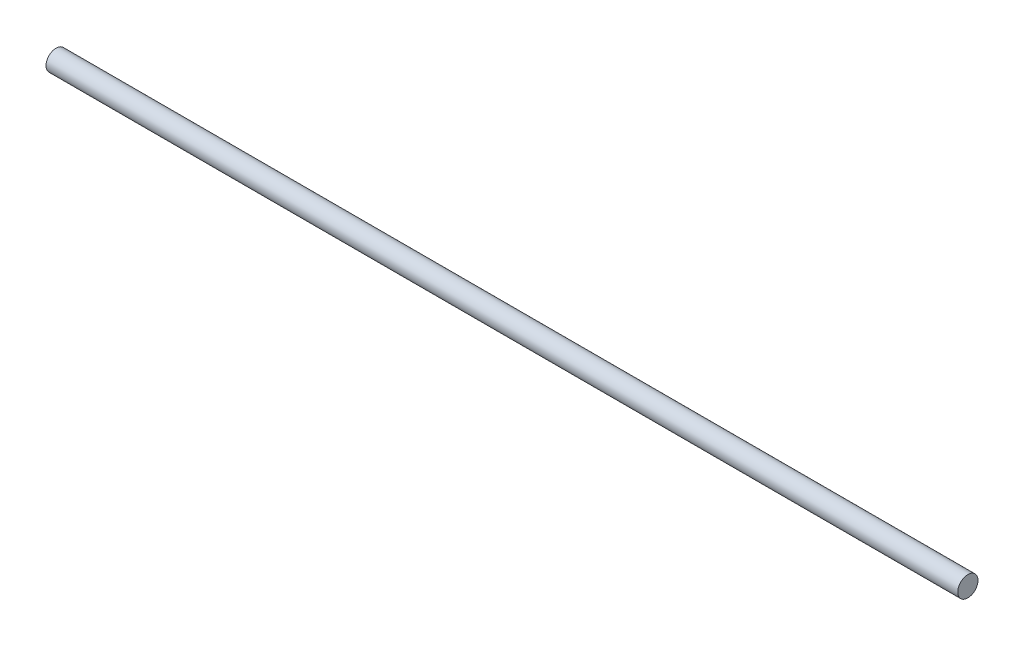
ISO-10303-21;
HEADER;
FILE_DESCRIPTION(('STEP AP214'),'2;1');
FILE_NAME('part.step','',(''),(''),'','','');
FILE_SCHEMA(('AUTOMOTIVE_DESIGN { 1 0 10303 214 1 1 1 1 }'));
ENDSEC;
DATA;
#1=APPLICATION_CONTEXT('core data for automotive mechanical design processes');
#2=APPLICATION_PROTOCOL_DEFINITION('international standard','automotive_design',2000,#1);
#3=PRODUCT_CONTEXT('',#1,'mechanical');
#4=PRODUCT('Part','Part','',(#3));
#5=PRODUCT_RELATED_PRODUCT_CATEGORY('part','',(#4));
#6=PRODUCT_DEFINITION_FORMATION('','',#4);
#7=PRODUCT_DEFINITION_CONTEXT('part definition',#1,'design');
#8=PRODUCT_DEFINITION('design','',#6,#7);
#9=PRODUCT_DEFINITION_SHAPE('','',#8);
#10=(LENGTH_UNIT() NAMED_UNIT(*) SI_UNIT(.MILLI.,.METRE.));
#11=(NAMED_UNIT(*) PLANE_ANGLE_UNIT() SI_UNIT($,.RADIAN.));
#12=(NAMED_UNIT(*) SI_UNIT($,.STERADIAN.) SOLID_ANGLE_UNIT());
#13=UNCERTAINTY_MEASURE_WITH_UNIT(LENGTH_MEASURE(1.E-05),#10,'distance_accuracy_value','');
#14=(GEOMETRIC_REPRESENTATION_CONTEXT(3) GLOBAL_UNCERTAINTY_ASSIGNED_CONTEXT((#13)) GLOBAL_UNIT_ASSIGNED_CONTEXT((#10,
#11,#12)) REPRESENTATION_CONTEXT('',''));
#15=CARTESIAN_POINT('',(0.,0.,0.));
#16=DIRECTION('',(0.,0.,1.));
#17=DIRECTION('',(1.,0.,0.));
#18=AXIS2_PLACEMENT_3D('',#15,#16,#17);
#19=CARTESIAN_POINT('',(571.5,0.,0.));
#20=DIRECTION('',(-1.,0.,0.));
#21=DIRECTION('',(0.,0.,1.));
#22=AXIS2_PLACEMENT_3D('',#19,#20,#21);
#23=CYLINDRICAL_SURFACE('',#22,6.35);
#24=CARTESIAN_POINT('',(571.5,0.,0.));
#25=DIRECTION('',(1.,0.,0.));
#26=DIRECTION('',(0.,0.,-1.));
#27=AXIS2_PLACEMENT_3D('',#24,#25,#26);
#28=CIRCLE('',#27,6.35);
#29=CARTESIAN_POINT('',(571.5,0.,-6.35));
#30=VERTEX_POINT('',#29);
#31=EDGE_CURVE('E10',#30,#30,#28,.T.);
#32=ORIENTED_EDGE('',*,*,#31,.F.);
#33=EDGE_LOOP('',(#32));
#34=FACE_BOUND('',#33,.T.);
#35=CARTESIAN_POINT('',(0.,0.,0.));
#36=DIRECTION('',(1.,0.,0.));
#37=DIRECTION('',(0.,0.,-1.));
#38=AXIS2_PLACEMENT_3D('',#35,#36,#37);
#39=CIRCLE('',#38,6.35);
#40=CARTESIAN_POINT('',(0.,0.,-6.35));
#41=VERTEX_POINT('',#40);
#42=EDGE_CURVE('E36',#41,#41,#39,.T.);
#43=ORIENTED_EDGE('',*,*,#42,.T.);
#44=EDGE_LOOP('',(#43));
#45=FACE_BOUND('',#44,.T.);
#46=ADVANCED_FACE('F33',(#34,#45),#23,.T.);
#47=CARTESIAN_POINT('',(571.5,0.,0.));
#48=DIRECTION('',(1.,0.,0.));
#49=DIRECTION('',(0.,0.,-1.));
#50=AXIS2_PLACEMENT_3D('',#47,#48,#49);
#51=PLANE('',#50);
#52=ORIENTED_EDGE('',*,*,#31,.T.);
#53=EDGE_LOOP('',(#52));
#54=FACE_BOUND('',#53,.T.);
#55=ADVANCED_FACE('F48',(#54),#51,.T.);
#56=CARTESIAN_POINT('',(0.,0.,0.));
#57=DIRECTION('',(1.,0.,0.));
#58=DIRECTION('',(0.,0.,-1.));
#59=AXIS2_PLACEMENT_3D('',#56,#57,#58);
#60=PLANE('',#59);
#61=ORIENTED_EDGE('',*,*,#42,.F.);
#62=EDGE_LOOP('',(#61));
#63=FACE_BOUND('',#62,.T.);
#64=ADVANCED_FACE('F46',(#63),#60,.F.);
#65=CLOSED_SHELL('',(#46,#55,#64));
#66=MANIFOLD_SOLID_BREP('B2',#65);
#67=ADVANCED_BREP_SHAPE_REPRESENTATION('',(#18,#66),#14);
#68=SHAPE_DEFINITION_REPRESENTATION(#9,#67);
ENDSEC;
END-ISO-10303-21;
